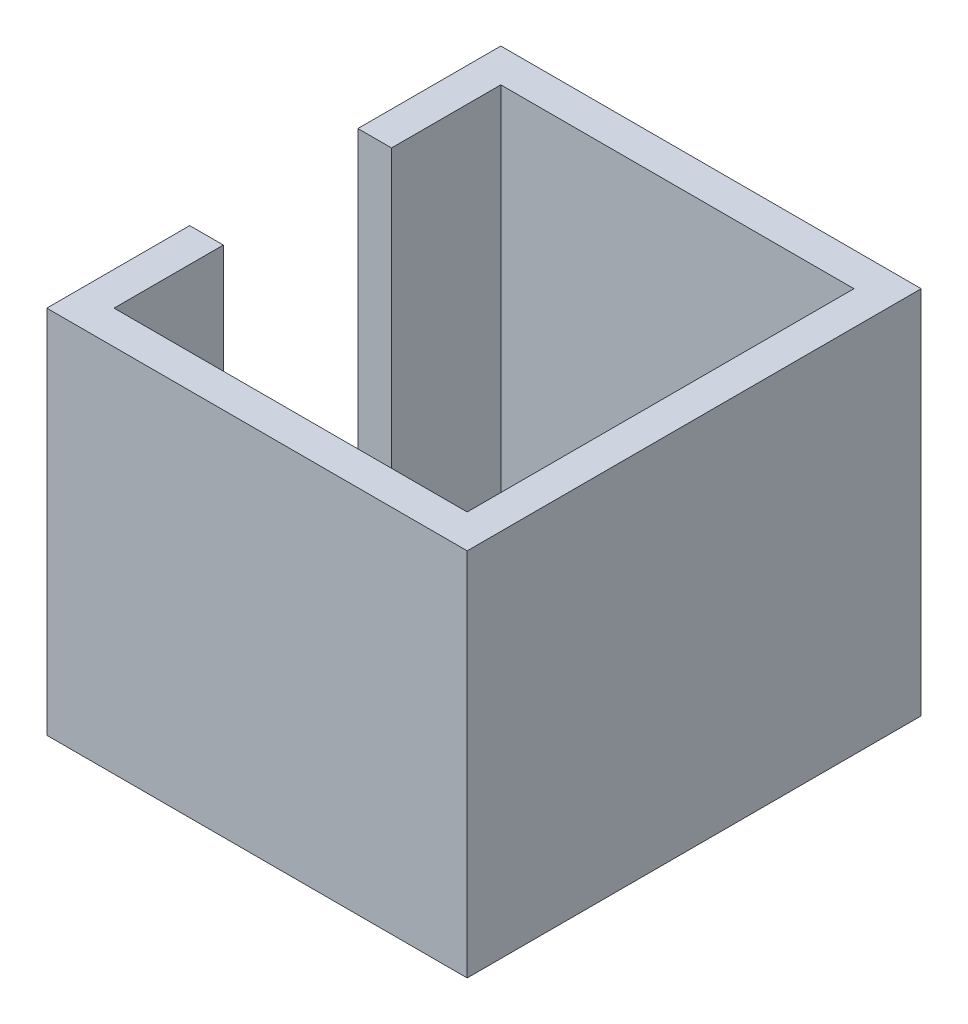
ISO-10303-21;
HEADER;
FILE_DESCRIPTION(('STEP AP214'),'2;1');
FILE_NAME('part.step','',(''),(''),'','','');
FILE_SCHEMA(('AUTOMOTIVE_DESIGN { 1 0 10303 214 1 1 1 1 }'));
ENDSEC;
DATA;
#1=APPLICATION_CONTEXT('core data for automotive mechanical design processes');
#2=APPLICATION_PROTOCOL_DEFINITION('international standard','automotive_design',2000,#1);
#3=PRODUCT_CONTEXT('',#1,'mechanical');
#4=PRODUCT('Part','Part','',(#3));
#5=PRODUCT_RELATED_PRODUCT_CATEGORY('part','',(#4));
#6=PRODUCT_DEFINITION_FORMATION('','',#4);
#7=PRODUCT_DEFINITION_CONTEXT('part definition',#1,'design');
#8=PRODUCT_DEFINITION('design','',#6,#7);
#9=PRODUCT_DEFINITION_SHAPE('','',#8);
#10=(LENGTH_UNIT() NAMED_UNIT(*) SI_UNIT(.MILLI.,.METRE.));
#11=(NAMED_UNIT(*) PLANE_ANGLE_UNIT() SI_UNIT($,.RADIAN.));
#12=(NAMED_UNIT(*) SI_UNIT($,.STERADIAN.) SOLID_ANGLE_UNIT());
#13=UNCERTAINTY_MEASURE_WITH_UNIT(LENGTH_MEASURE(1.E-05),#10,'distance_accuracy_value','');
#14=(GEOMETRIC_REPRESENTATION_CONTEXT(3) GLOBAL_UNCERTAINTY_ASSIGNED_CONTEXT((#13)) GLOBAL_UNIT_ASSIGNED_CONTEXT((#10,
#11,#12)) REPRESENTATION_CONTEXT('',''));
#15=CARTESIAN_POINT('',(0.,0.,0.));
#16=DIRECTION('',(0.,0.,1.));
#17=DIRECTION('',(1.,0.,0.));
#18=AXIS2_PLACEMENT_3D('',#15,#16,#17);
#19=CARTESIAN_POINT('',(0.,11.,0.));
#20=DIRECTION('',(0.,1.,0.));
#21=DIRECTION('',(0.,0.,1.));
#22=AXIS2_PLACEMENT_3D('',#19,#20,#21);
#23=PLANE('',#22);
#24=DIRECTION('',(1.,0.,0.));
#25=VECTOR('',#24,1.);
#26=CARTESIAN_POINT('',(-13.5,11.,5.));
#27=LINE('',#26,#25);
#28=CARTESIAN_POINT('',(-12.5,11.,5.));
#29=VERTEX_POINT('',#28);
#30=CARTESIAN_POINT('',(-10.5,11.,5.));
#31=VERTEX_POINT('',#30);
#32=EDGE_CURVE('E153',#29,#31,#27,.T.);
#33=ORIENTED_EDGE('',*,*,#32,.F.);
#34=DIRECTION('',(0.,0.,1.));
#35=VECTOR('',#34,1.);
#36=CARTESIAN_POINT('',(-12.5,11.,-13.5));
#37=LINE('',#36,#35);
#38=CARTESIAN_POINT('',(-12.5,11.,13.5));
#39=VERTEX_POINT('',#38);
#40=EDGE_CURVE('E198',#29,#39,#37,.T.);
#41=ORIENTED_EDGE('',*,*,#40,.T.);
#42=DIRECTION('',(1.,0.,0.));
#43=VECTOR('',#42,1.);
#44=CARTESIAN_POINT('',(-12.5,11.,13.5));
#45=LINE('',#44,#43);
#46=CARTESIAN_POINT('',(12.5,11.,13.5));
#47=VERTEX_POINT('',#46);
#48=EDGE_CURVE('E202',#39,#47,#45,.T.);
#49=ORIENTED_EDGE('',*,*,#48,.T.);
#50=DIRECTION('',(0.,0.,-1.));
#51=VECTOR('',#50,1.);
#52=CARTESIAN_POINT('',(12.5,11.,-13.5));
#53=LINE('',#52,#51);
#54=CARTESIAN_POINT('',(12.5,11.,-13.5));
#55=VERTEX_POINT('',#54);
#56=EDGE_CURVE('E192',#47,#55,#53,.T.);
#57=ORIENTED_EDGE('',*,*,#56,.T.);
#58=DIRECTION('',(-1.,0.,0.));
#59=VECTOR('',#58,1.);
#60=CARTESIAN_POINT('',(-12.5,11.,-13.5));
#61=LINE('',#60,#59);
#62=CARTESIAN_POINT('',(-12.5,11.,-13.5));
#63=VERTEX_POINT('',#62);
#64=EDGE_CURVE('E195',#55,#63,#61,.T.);
#65=ORIENTED_EDGE('',*,*,#64,.T.);
#66=CARTESIAN_POINT('',(-12.5,11.,-5.));
#67=VERTEX_POINT('',#66);
#68=EDGE_CURVE('E199',#63,#67,#37,.T.);
#69=ORIENTED_EDGE('',*,*,#68,.T.);
#70=DIRECTION('',(1.,0.,0.));
#71=VECTOR('',#70,1.);
#72=CARTESIAN_POINT('',(-13.5,11.,-5.));
#73=LINE('',#72,#71);
#74=CARTESIAN_POINT('',(-10.5,11.,-5.));
#75=VERTEX_POINT('',#74);
#76=EDGE_CURVE('E136',#67,#75,#73,.T.);
#77=ORIENTED_EDGE('',*,*,#76,.T.);
#78=DIRECTION('',(0.,0.,1.));
#79=VECTOR('',#78,1.);
#80=CARTESIAN_POINT('',(-10.5,11.,-11.5));
#81=LINE('',#80,#79);
#82=CARTESIAN_POINT('',(-10.5,11.,-11.5));
#83=VERTEX_POINT('',#82);
#84=EDGE_CURVE('E148',#83,#75,#81,.T.);
#85=ORIENTED_EDGE('',*,*,#84,.F.);
#86=DIRECTION('',(-1.,0.,0.));
#87=VECTOR('',#86,1.);
#88=CARTESIAN_POINT('',(-10.5,11.,-11.5));
#89=LINE('',#88,#87);
#90=CARTESIAN_POINT('',(10.5,11.,-11.5));
#91=VERTEX_POINT('',#90);
#92=EDGE_CURVE('E169',#91,#83,#89,.T.);
#93=ORIENTED_EDGE('',*,*,#92,.F.);
#94=DIRECTION('',(0.,0.,-1.));
#95=VECTOR('',#94,1.);
#96=CARTESIAN_POINT('',(10.5,11.,-11.5));
#97=LINE('',#96,#95);
#98=CARTESIAN_POINT('',(10.5,11.,11.5));
#99=VERTEX_POINT('',#98);
#100=EDGE_CURVE('E167',#99,#91,#97,.T.);
#101=ORIENTED_EDGE('',*,*,#100,.F.);
#102=DIRECTION('',(1.,0.,0.));
#103=VECTOR('',#102,1.);
#104=CARTESIAN_POINT('',(-10.5,11.,11.5));
#105=LINE('',#104,#103);
#106=CARTESIAN_POINT('',(-10.5,11.,11.5));
#107=VERTEX_POINT('',#106);
#108=EDGE_CURVE('E164',#107,#99,#105,.T.);
#109=ORIENTED_EDGE('',*,*,#108,.F.);
#110=EDGE_CURVE('E165',#31,#107,#81,.T.);
#111=ORIENTED_EDGE('',*,*,#110,.F.);
#112=EDGE_LOOP('',(#33,#41,#49,#57,#65,#69,#77,#85,#93,#101,#109,#111));
#113=FACE_BOUND('',#112,.T.);
#114=ADVANCED_FACE('F37',(#113),#23,.T.);
#115=CARTESIAN_POINT('',(0.,-11.,0.));
#116=DIRECTION('',(0.,1.,0.));
#117=DIRECTION('',(0.,0.,1.));
#118=AXIS2_PLACEMENT_3D('',#115,#116,#117);
#119=PLANE('',#118);
#120=DIRECTION('',(0.,0.,-1.));
#121=VECTOR('',#120,1.);
#122=CARTESIAN_POINT('',(12.5,-11.,-13.5));
#123=LINE('',#122,#121);
#124=CARTESIAN_POINT('',(12.5,-11.,13.5));
#125=VERTEX_POINT('',#124);
#126=CARTESIAN_POINT('',(12.5,-11.,-13.5));
#127=VERTEX_POINT('',#126);
#128=EDGE_CURVE('E191',#125,#127,#123,.T.);
#129=ORIENTED_EDGE('',*,*,#128,.F.);
#130=DIRECTION('',(1.,0.,0.));
#131=VECTOR('',#130,1.);
#132=CARTESIAN_POINT('',(-12.5,-11.,13.5));
#133=LINE('',#132,#131);
#134=CARTESIAN_POINT('',(-12.5,-11.,13.5));
#135=VERTEX_POINT('',#134);
#136=EDGE_CURVE('E196',#135,#125,#133,.T.);
#137=ORIENTED_EDGE('',*,*,#136,.F.);
#138=DIRECTION('',(0.,0.,1.));
#139=VECTOR('',#138,1.);
#140=CARTESIAN_POINT('',(-12.5,-11.,-13.5));
#141=LINE('',#140,#139);
#142=CARTESIAN_POINT('',(-12.5,-11.,-13.5));
#143=VERTEX_POINT('',#142);
#144=EDGE_CURVE('E209',#143,#135,#141,.T.);
#145=ORIENTED_EDGE('',*,*,#144,.F.);
#146=DIRECTION('',(-1.,0.,0.));
#147=VECTOR('',#146,1.);
#148=CARTESIAN_POINT('',(-12.5,-11.,-13.5));
#149=LINE('',#148,#147);
#150=EDGE_CURVE('E207',#127,#143,#149,.T.);
#151=ORIENTED_EDGE('',*,*,#150,.F.);
#152=EDGE_LOOP('',(#129,#137,#145,#151));
#153=FACE_BOUND('',#152,.T.);
#154=DIRECTION('',(0.,0.,1.));
#155=VECTOR('',#154,1.);
#156=CARTESIAN_POINT('',(-10.5,-11.,-11.5));
#157=LINE('',#156,#155);
#158=CARTESIAN_POINT('',(-10.5,-11.,-11.5));
#159=VERTEX_POINT('',#158);
#160=CARTESIAN_POINT('',(-10.5,-11.,11.5));
#161=VERTEX_POINT('',#160);
#162=EDGE_CURVE('E162',#159,#161,#157,.T.);
#163=ORIENTED_EDGE('',*,*,#162,.T.);
#164=DIRECTION('',(1.,0.,0.));
#165=VECTOR('',#164,1.);
#166=CARTESIAN_POINT('',(-10.5,-11.,11.5));
#167=LINE('',#166,#165);
#168=CARTESIAN_POINT('',(10.5,-11.,11.5));
#169=VERTEX_POINT('',#168);
#170=EDGE_CURVE('E174',#161,#169,#167,.T.);
#171=ORIENTED_EDGE('',*,*,#170,.T.);
#172=DIRECTION('',(0.,0.,-1.));
#173=VECTOR('',#172,1.);
#174=CARTESIAN_POINT('',(10.5,-11.,-11.5));
#175=LINE('',#174,#173);
#176=CARTESIAN_POINT('',(10.5,-11.,-11.5));
#177=VERTEX_POINT('',#176);
#178=EDGE_CURVE('E177',#169,#177,#175,.T.);
#179=ORIENTED_EDGE('',*,*,#178,.T.);
#180=DIRECTION('',(-1.,0.,0.));
#181=VECTOR('',#180,1.);
#182=CARTESIAN_POINT('',(-10.5,-11.,-11.5));
#183=LINE('',#182,#181);
#184=EDGE_CURVE('E180',#177,#159,#183,.T.);
#185=ORIENTED_EDGE('',*,*,#184,.T.);
#186=EDGE_LOOP('',(#163,#171,#179,#185));
#187=FACE_BOUND('',#186,.T.);
#188=ADVANCED_FACE('F228',(#153,#187),#119,.F.);
#189=CARTESIAN_POINT('',(12.5,11.,-13.5));
#190=DIRECTION('',(-1.,0.,0.));
#191=DIRECTION('',(0.,0.,1.));
#192=AXIS2_PLACEMENT_3D('',#189,#190,#191);
#193=PLANE('',#192);
#194=ORIENTED_EDGE('',*,*,#128,.T.);
#195=DIRECTION('',(0.,-1.,0.));
#196=VECTOR('',#195,1.);
#197=CARTESIAN_POINT('',(12.5,11.,-13.5));
#198=LINE('',#197,#196);
#199=EDGE_CURVE('E11',#55,#127,#198,.T.);
#200=ORIENTED_EDGE('',*,*,#199,.F.);
#201=ORIENTED_EDGE('',*,*,#56,.F.);
#202=DIRECTION('',(0.,-1.,0.));
#203=VECTOR('',#202,1.);
#204=CARTESIAN_POINT('',(12.5,11.,13.5));
#205=LINE('',#204,#203);
#206=EDGE_CURVE('E204',#47,#125,#205,.T.);
#207=ORIENTED_EDGE('',*,*,#206,.T.);
#208=EDGE_LOOP('',(#194,#200,#201,#207));
#209=FACE_BOUND('',#208,.T.);
#210=ADVANCED_FACE('F39',(#209),#193,.F.);
#211=CARTESIAN_POINT('',(-12.5,11.,-13.5));
#212=DIRECTION('',(0.,0.,1.));
#213=DIRECTION('',(1.,0.,0.));
#214=AXIS2_PLACEMENT_3D('',#211,#212,#213);
#215=PLANE('',#214);
#216=ORIENTED_EDGE('',*,*,#150,.T.);
#217=DIRECTION('',(0.,-1.,0.));
#218=VECTOR('',#217,1.);
#219=CARTESIAN_POINT('',(-12.5,11.,-13.5));
#220=LINE('',#219,#218);
#221=EDGE_CURVE('E45',#63,#143,#220,.T.);
#222=ORIENTED_EDGE('',*,*,#221,.F.);
#223=ORIENTED_EDGE('',*,*,#64,.F.);
#224=ORIENTED_EDGE('',*,*,#199,.T.);
#225=EDGE_LOOP('',(#216,#222,#223,#224));
#226=FACE_BOUND('',#225,.T.);
#227=ADVANCED_FACE('F272',(#226),#215,.F.);
#228=CARTESIAN_POINT('',(-12.5,11.,-13.5));
#229=DIRECTION('',(1.,0.,0.));
#230=DIRECTION('',(0.,0.,-1.));
#231=AXIS2_PLACEMENT_3D('',#228,#229,#230);
#232=PLANE('',#231);
#233=ORIENTED_EDGE('',*,*,#40,.F.);
#234=DIRECTION('',(0.,-1.,0.));
#235=VECTOR('',#234,1.);
#236=CARTESIAN_POINT('',(-12.5,11.,5.00000000000001));
#237=LINE('',#236,#235);
#238=CARTESIAN_POINT('',(-12.5,-6.,5.));
#239=VERTEX_POINT('',#238);
#240=EDGE_CURVE('E159',#29,#239,#237,.T.);
#241=ORIENTED_EDGE('',*,*,#240,.T.);
#242=DIRECTION('',(0.,0.,-1.));
#243=VECTOR('',#242,1.);
#244=CARTESIAN_POINT('',(-12.5,-6.,-13.5));
#245=LINE('',#244,#243);
#246=CARTESIAN_POINT('',(-12.5,-6.,-5.));
#247=VERTEX_POINT('',#246);
#248=EDGE_CURVE('E155',#239,#247,#245,.T.);
#249=ORIENTED_EDGE('',*,*,#248,.T.);
#250=DIRECTION('',(0.,1.,0.));
#251=VECTOR('',#250,1.);
#252=CARTESIAN_POINT('',(-12.5,11.,-5.));
#253=LINE('',#252,#251);
#254=EDGE_CURVE('E133',#247,#67,#253,.T.);
#255=ORIENTED_EDGE('',*,*,#254,.T.);
#256=ORIENTED_EDGE('',*,*,#68,.F.);
#257=ORIENTED_EDGE('',*,*,#221,.T.);
#258=ORIENTED_EDGE('',*,*,#144,.T.);
#259=DIRECTION('',(0.,-1.,0.));
#260=VECTOR('',#259,1.);
#261=CARTESIAN_POINT('',(-12.5,11.,13.5));
#262=LINE('',#261,#260);
#263=EDGE_CURVE('E214',#39,#135,#262,.T.);
#264=ORIENTED_EDGE('',*,*,#263,.F.);
#265=EDGE_LOOP('',(#233,#241,#249,#255,#256,#257,#258,#264));
#266=FACE_BOUND('',#265,.T.);
#267=ADVANCED_FACE('F222',(#266),#232,.F.);
#268=CARTESIAN_POINT('',(-12.5,11.,13.5));
#269=DIRECTION('',(0.,0.,-1.));
#270=DIRECTION('',(-1.,0.,0.));
#271=AXIS2_PLACEMENT_3D('',#268,#269,#270);
#272=PLANE('',#271);
#273=ORIENTED_EDGE('',*,*,#136,.T.);
#274=ORIENTED_EDGE('',*,*,#206,.F.);
#275=ORIENTED_EDGE('',*,*,#48,.F.);
#276=ORIENTED_EDGE('',*,*,#263,.T.);
#277=EDGE_LOOP('',(#273,#274,#275,#276));
#278=FACE_BOUND('',#277,.T.);
#279=ADVANCED_FACE('F232',(#278),#272,.F.);
#280=CARTESIAN_POINT('',(-10.5,11.,-11.5));
#281=DIRECTION('',(1.,0.,0.));
#282=DIRECTION('',(0.,0.,-1.));
#283=AXIS2_PLACEMENT_3D('',#280,#281,#282);
#284=PLANE('',#283);
#285=DIRECTION('',(0.,-1.,0.));
#286=VECTOR('',#285,1.);
#287=CARTESIAN_POINT('',(-10.5,11.,5.));
#288=LINE('',#287,#286);
#289=CARTESIAN_POINT('',(-10.5,-6.,5.));
#290=VERTEX_POINT('',#289);
#291=EDGE_CURVE('E52',#31,#290,#288,.T.);
#292=ORIENTED_EDGE('',*,*,#291,.F.);
#293=ORIENTED_EDGE('',*,*,#110,.T.);
#294=DIRECTION('',(0.,-1.,0.));
#295=VECTOR('',#294,1.);
#296=CARTESIAN_POINT('',(-10.5,11.,11.5));
#297=LINE('',#296,#295);
#298=EDGE_CURVE('E188',#107,#161,#297,.T.);
#299=ORIENTED_EDGE('',*,*,#298,.T.);
#300=ORIENTED_EDGE('',*,*,#162,.F.);
#301=DIRECTION('',(0.,-1.,0.));
#302=VECTOR('',#301,1.);
#303=CARTESIAN_POINT('',(-10.5,11.,-11.5));
#304=LINE('',#303,#302);
#305=EDGE_CURVE('E171',#83,#159,#304,.T.);
#306=ORIENTED_EDGE('',*,*,#305,.F.);
#307=ORIENTED_EDGE('',*,*,#84,.T.);
#308=DIRECTION('',(0.,1.,0.));
#309=VECTOR('',#308,1.);
#310=CARTESIAN_POINT('',(-10.5,11.,-5.));
#311=LINE('',#310,#309);
#312=CARTESIAN_POINT('',(-10.5,-6.,-5.));
#313=VERTEX_POINT('',#312);
#314=EDGE_CURVE('E130',#313,#75,#311,.T.);
#315=ORIENTED_EDGE('',*,*,#314,.F.);
#316=DIRECTION('',(0.,0.,-1.));
#317=VECTOR('',#316,1.);
#318=CARTESIAN_POINT('',(-10.5,-6.,-11.5));
#319=LINE('',#318,#317);
#320=EDGE_CURVE('E140',#290,#313,#319,.T.);
#321=ORIENTED_EDGE('',*,*,#320,.F.);
#322=EDGE_LOOP('',(#292,#293,#299,#300,#306,#307,#315,#321));
#323=FACE_BOUND('',#322,.T.);
#324=ADVANCED_FACE('F145',(#323),#284,.T.);
#325=CARTESIAN_POINT('',(-10.5,11.,11.5));
#326=DIRECTION('',(0.,0.,-1.));
#327=DIRECTION('',(-1.,0.,0.));
#328=AXIS2_PLACEMENT_3D('',#325,#326,#327);
#329=PLANE('',#328);
#330=ORIENTED_EDGE('',*,*,#170,.F.);
#331=ORIENTED_EDGE('',*,*,#298,.F.);
#332=ORIENTED_EDGE('',*,*,#108,.T.);
#333=DIRECTION('',(0.,-1.,0.));
#334=VECTOR('',#333,1.);
#335=CARTESIAN_POINT('',(10.5,11.,11.5));
#336=LINE('',#335,#334);
#337=EDGE_CURVE('E186',#99,#169,#336,.T.);
#338=ORIENTED_EDGE('',*,*,#337,.T.);
#339=EDGE_LOOP('',(#330,#331,#332,#338));
#340=FACE_BOUND('',#339,.T.);
#341=ADVANCED_FACE('F247',(#340),#329,.T.);
#342=CARTESIAN_POINT('',(10.5,11.,-11.5));
#343=DIRECTION('',(-1.,0.,0.));
#344=DIRECTION('',(0.,0.,1.));
#345=AXIS2_PLACEMENT_3D('',#342,#343,#344);
#346=PLANE('',#345);
#347=ORIENTED_EDGE('',*,*,#178,.F.);
#348=ORIENTED_EDGE('',*,*,#337,.F.);
#349=ORIENTED_EDGE('',*,*,#100,.T.);
#350=DIRECTION('',(0.,-1.,0.));
#351=VECTOR('',#350,1.);
#352=CARTESIAN_POINT('',(10.5,11.,-11.5));
#353=LINE('',#352,#351);
#354=EDGE_CURVE('E60',#91,#177,#353,.T.);
#355=ORIENTED_EDGE('',*,*,#354,.T.);
#356=EDGE_LOOP('',(#347,#348,#349,#355));
#357=FACE_BOUND('',#356,.T.);
#358=ADVANCED_FACE('F250',(#357),#346,.T.);
#359=CARTESIAN_POINT('',(-10.5,11.,-11.5));
#360=DIRECTION('',(0.,0.,1.));
#361=DIRECTION('',(1.,0.,0.));
#362=AXIS2_PLACEMENT_3D('',#359,#360,#361);
#363=PLANE('',#362);
#364=ORIENTED_EDGE('',*,*,#184,.F.);
#365=ORIENTED_EDGE('',*,*,#354,.F.);
#366=ORIENTED_EDGE('',*,*,#92,.T.);
#367=ORIENTED_EDGE('',*,*,#305,.T.);
#368=EDGE_LOOP('',(#364,#365,#366,#367));
#369=FACE_BOUND('',#368,.T.);
#370=ADVANCED_FACE('F251',(#369),#363,.T.);
#371=CARTESIAN_POINT('',(-13.5,11.,5.));
#372=DIRECTION('',(0.,0.,1.));
#373=DIRECTION('',(1.,0.,0.));
#374=AXIS2_PLACEMENT_3D('',#371,#372,#373);
#375=PLANE('',#374);
#376=ORIENTED_EDGE('',*,*,#32,.T.);
#377=ORIENTED_EDGE('',*,*,#291,.T.);
#378=DIRECTION('',(1.,0.,0.));
#379=VECTOR('',#378,1.);
#380=CARTESIAN_POINT('',(-13.5,-6.,5.));
#381=LINE('',#380,#379);
#382=EDGE_CURVE('E137',#239,#290,#381,.T.);
#383=ORIENTED_EDGE('',*,*,#382,.F.);
#384=ORIENTED_EDGE('',*,*,#240,.F.);
#385=EDGE_LOOP('',(#376,#377,#383,#384));
#386=FACE_BOUND('',#385,.T.);
#387=ADVANCED_FACE('F240',(#386),#375,.F.);
#388=CARTESIAN_POINT('',(-13.5,11.,-5.));
#389=DIRECTION('',(0.,0.,-1.));
#390=DIRECTION('',(-1.,0.,0.));
#391=AXIS2_PLACEMENT_3D('',#388,#389,#390);
#392=PLANE('',#391);
#393=DIRECTION('',(1.,0.,0.));
#394=VECTOR('',#393,1.);
#395=CARTESIAN_POINT('',(-13.5,-6.,-5.));
#396=LINE('',#395,#394);
#397=EDGE_CURVE('E126',#247,#313,#396,.T.);
#398=ORIENTED_EDGE('',*,*,#397,.T.);
#399=ORIENTED_EDGE('',*,*,#314,.T.);
#400=ORIENTED_EDGE('',*,*,#76,.F.);
#401=ORIENTED_EDGE('',*,*,#254,.F.);
#402=EDGE_LOOP('',(#398,#399,#400,#401));
#403=FACE_BOUND('',#402,.T.);
#404=ADVANCED_FACE('F128',(#403),#392,.F.);
#405=CARTESIAN_POINT('',(-13.5,-6.,-11.5));
#406=DIRECTION('',(0.,-1.,0.));
#407=DIRECTION('',(0.,0.,-1.));
#408=AXIS2_PLACEMENT_3D('',#405,#406,#407);
#409=PLANE('',#408);
#410=ORIENTED_EDGE('',*,*,#382,.T.);
#411=ORIENTED_EDGE('',*,*,#320,.T.);
#412=ORIENTED_EDGE('',*,*,#397,.F.);
#413=ORIENTED_EDGE('',*,*,#248,.F.);
#414=EDGE_LOOP('',(#410,#411,#412,#413));
#415=FACE_BOUND('',#414,.T.);
#416=ADVANCED_FACE('F141',(#415),#409,.F.);
#417=CLOSED_SHELL('',(#114,#188,#210,#227,#267,#279,#324,#341,#358,#370,#387,#404,#416));
#418=MANIFOLD_SOLID_BREP('B2',#417);
#419=ADVANCED_BREP_SHAPE_REPRESENTATION('',(#18,#418),#14);
#420=SHAPE_DEFINITION_REPRESENTATION(#9,#419);
ENDSEC;
END-ISO-10303-21;
